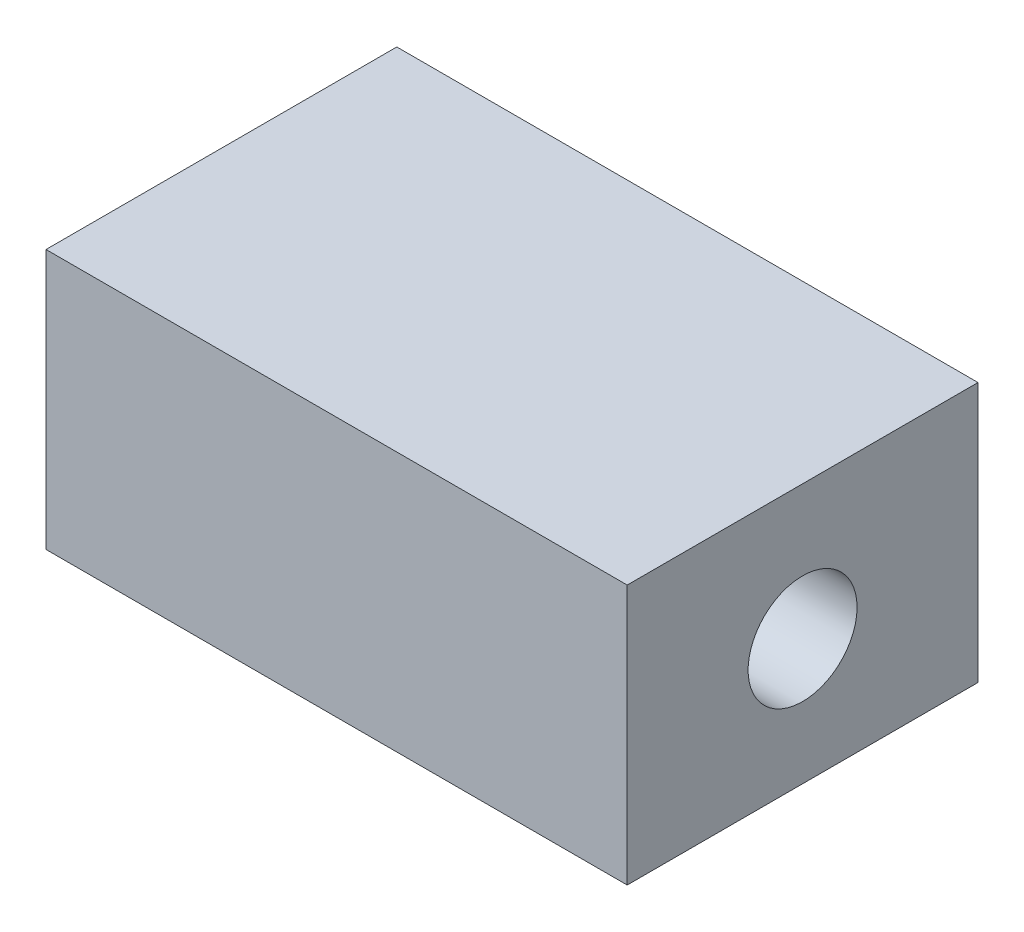
ISO-10303-21;
HEADER;
FILE_DESCRIPTION(('STEP AP214'),'2;1');
FILE_NAME('part.step','',(''),(''),'','','');
FILE_SCHEMA(('AUTOMOTIVE_DESIGN { 1 0 10303 214 1 1 1 1 }'));
ENDSEC;
DATA;
#1=APPLICATION_CONTEXT('core data for automotive mechanical design processes');
#2=APPLICATION_PROTOCOL_DEFINITION('international standard','automotive_design',2000,#1);
#3=PRODUCT_CONTEXT('',#1,'mechanical');
#4=PRODUCT('Part','Part','',(#3));
#5=PRODUCT_RELATED_PRODUCT_CATEGORY('part','',(#4));
#6=PRODUCT_DEFINITION_FORMATION('','',#4);
#7=PRODUCT_DEFINITION_CONTEXT('part definition',#1,'design');
#8=PRODUCT_DEFINITION('design','',#6,#7);
#9=PRODUCT_DEFINITION_SHAPE('','',#8);
#10=(LENGTH_UNIT() NAMED_UNIT(*) SI_UNIT(.MILLI.,.METRE.));
#11=(NAMED_UNIT(*) PLANE_ANGLE_UNIT() SI_UNIT($,.RADIAN.));
#12=(NAMED_UNIT(*) SI_UNIT($,.STERADIAN.) SOLID_ANGLE_UNIT());
#13=UNCERTAINTY_MEASURE_WITH_UNIT(LENGTH_MEASURE(1.E-05),#10,'distance_accuracy_value','');
#14=(GEOMETRIC_REPRESENTATION_CONTEXT(3) GLOBAL_UNCERTAINTY_ASSIGNED_CONTEXT((#13)) GLOBAL_UNIT_ASSIGNED_CONTEXT((#10,
#11,#12)) REPRESENTATION_CONTEXT('',''));
#15=CARTESIAN_POINT('',(0.,0.,0.));
#16=DIRECTION('',(0.,0.,1.));
#17=DIRECTION('',(1.,0.,0.));
#18=AXIS2_PLACEMENT_3D('',#15,#16,#17);
#19=CARTESIAN_POINT('',(55.9256768537199,50.,-33.7539588111209));
#20=DIRECTION('',(-1.,0.,0.));
#21=DIRECTION('',(0.,0.,1.));
#22=AXIS2_PLACEMENT_3D('',#19,#20,#21);
#23=PLANE('',#22);
#24=CARTESIAN_POINT('',(55.9256768537199,24.1825877409828,0.));
#25=DIRECTION('',(1.,0.,0.));
#26=DIRECTION('',(0.,0.,-1.));
#27=AXIS2_PLACEMENT_3D('',#24,#25,#26);
#28=CIRCLE('',#27,10.4813649082559);
#29=CARTESIAN_POINT('',(55.9256768537199,24.1825877409828,-10.4813649082559));
#30=VERTEX_POINT('',#29);
#31=EDGE_CURVE('E114',#30,#30,#28,.T.);
#32=ORIENTED_EDGE('',*,*,#31,.F.);
#33=EDGE_LOOP('',(#32));
#34=FACE_BOUND('',#33,.T.);
#35=DIRECTION('',(0.,0.,-1.));
#36=VECTOR('',#35,1.);
#37=CARTESIAN_POINT('',(55.9256768537199,0.,-33.7539588111209));
#38=LINE('',#37,#36);
#39=CARTESIAN_POINT('',(55.9256768537199,0.,33.7539588111209));
#40=VERTEX_POINT('',#39);
#41=CARTESIAN_POINT('',(55.9256768537199,0.,-33.7539588111209));
#42=VERTEX_POINT('',#41);
#43=EDGE_CURVE('E100',#40,#42,#38,.T.);
#44=ORIENTED_EDGE('',*,*,#43,.T.);
#45=DIRECTION('',(0.,-1.,0.));
#46=VECTOR('',#45,1.);
#47=CARTESIAN_POINT('',(55.9256768537199,50.,-33.7539588111209));
#48=LINE('',#47,#46);
#49=CARTESIAN_POINT('',(55.9256768537199,50.,-33.7539588111209));
#50=VERTEX_POINT('',#49);
#51=EDGE_CURVE('E11',#50,#42,#48,.T.);
#52=ORIENTED_EDGE('',*,*,#51,.F.);
#53=DIRECTION('',(0.,0.,-1.));
#54=VECTOR('',#53,1.);
#55=CARTESIAN_POINT('',(55.9256768537199,50.,-33.7539588111209));
#56=LINE('',#55,#54);
#57=CARTESIAN_POINT('',(55.9256768537199,50.,33.7539588111209));
#58=VERTEX_POINT('',#57);
#59=EDGE_CURVE('E88',#58,#50,#56,.T.);
#60=ORIENTED_EDGE('',*,*,#59,.F.);
#61=DIRECTION('',(0.,-1.,0.));
#62=VECTOR('',#61,1.);
#63=CARTESIAN_POINT('',(55.9256768537199,50.,33.7539588111209));
#64=LINE('',#63,#62);
#65=EDGE_CURVE('E96',#58,#40,#64,.T.);
#66=ORIENTED_EDGE('',*,*,#65,.T.);
#67=EDGE_LOOP('',(#44,#52,#60,#66));
#68=FACE_BOUND('',#67,.T.);
#69=ADVANCED_FACE('F37',(#34,#68),#23,.F.);
#70=CARTESIAN_POINT('',(-55.9256768537199,50.,-33.7539588111209));
#71=DIRECTION('',(0.,0.,1.));
#72=DIRECTION('',(1.,0.,0.));
#73=AXIS2_PLACEMENT_3D('',#70,#71,#72);
#74=PLANE('',#73);
#75=DIRECTION('',(-1.,0.,0.));
#76=VECTOR('',#75,1.);
#77=CARTESIAN_POINT('',(-55.9256768537199,0.,-33.7539588111209));
#78=LINE('',#77,#76);
#79=CARTESIAN_POINT('',(-55.9256768537199,0.,-33.7539588111209));
#80=VERTEX_POINT('',#79);
#81=EDGE_CURVE('E92',#42,#80,#78,.T.);
#82=ORIENTED_EDGE('',*,*,#81,.T.);
#83=DIRECTION('',(0.,-1.,0.));
#84=VECTOR('',#83,1.);
#85=CARTESIAN_POINT('',(-55.9256768537199,50.,-33.7539588111209));
#86=LINE('',#85,#84);
#87=CARTESIAN_POINT('',(-55.9256768537199,50.,-33.7539588111209));
#88=VERTEX_POINT('',#87);
#89=EDGE_CURVE('E45',#88,#80,#86,.T.);
#90=ORIENTED_EDGE('',*,*,#89,.F.);
#91=DIRECTION('',(-1.,0.,0.));
#92=VECTOR('',#91,1.);
#93=CARTESIAN_POINT('',(-55.9256768537199,50.,-33.7539588111209));
#94=LINE('',#93,#92);
#95=EDGE_CURVE('E83',#50,#88,#94,.T.);
#96=ORIENTED_EDGE('',*,*,#95,.F.);
#97=ORIENTED_EDGE('',*,*,#51,.T.);
#98=EDGE_LOOP('',(#82,#90,#96,#97));
#99=FACE_BOUND('',#98,.T.);
#100=ADVANCED_FACE('F91',(#99),#74,.F.);
#101=CARTESIAN_POINT('',(-55.9256768537199,50.,-33.7539588111209));
#102=DIRECTION('',(1.,0.,0.));
#103=DIRECTION('',(0.,0.,-1.));
#104=AXIS2_PLACEMENT_3D('',#101,#102,#103);
#105=PLANE('',#104);
#106=CARTESIAN_POINT('',(-55.9256768537199,24.1825877409828,0.));
#107=DIRECTION('',(1.,0.,0.));
#108=DIRECTION('',(0.,0.,-1.));
#109=AXIS2_PLACEMENT_3D('',#106,#107,#108);
#110=CIRCLE('',#109,10.4813649082559);
#111=CARTESIAN_POINT('',(-55.9256768537199,24.1825877409828,-10.4813649082559));
#112=VERTEX_POINT('',#111);
#113=EDGE_CURVE('E103',#112,#112,#110,.T.);
#114=ORIENTED_EDGE('',*,*,#113,.T.);
#115=EDGE_LOOP('',(#114));
#116=FACE_BOUND('',#115,.T.);
#117=DIRECTION('',(0.,0.,1.));
#118=VECTOR('',#117,1.);
#119=CARTESIAN_POINT('',(-55.9256768537199,0.,-33.7539588111209));
#120=LINE('',#119,#118);
#121=CARTESIAN_POINT('',(-55.9256768537199,0.,33.7539588111209));
#122=VERTEX_POINT('',#121);
#123=EDGE_CURVE('E70',#80,#122,#120,.T.);
#124=ORIENTED_EDGE('',*,*,#123,.T.);
#125=DIRECTION('',(0.,-1.,0.));
#126=VECTOR('',#125,1.);
#127=CARTESIAN_POINT('',(-55.9256768537199,50.,33.7539588111209));
#128=LINE('',#127,#126);
#129=CARTESIAN_POINT('',(-55.9256768537199,50.,33.7539588111209));
#130=VERTEX_POINT('',#129);
#131=EDGE_CURVE('E93',#130,#122,#128,.T.);
#132=ORIENTED_EDGE('',*,*,#131,.F.);
#133=DIRECTION('',(0.,0.,1.));
#134=VECTOR('',#133,1.);
#135=CARTESIAN_POINT('',(-55.9256768537199,50.,-33.7539588111209));
#136=LINE('',#135,#134);
#137=EDGE_CURVE('E86',#88,#130,#136,.T.);
#138=ORIENTED_EDGE('',*,*,#137,.F.);
#139=ORIENTED_EDGE('',*,*,#89,.T.);
#140=EDGE_LOOP('',(#124,#132,#138,#139));
#141=FACE_BOUND('',#140,.T.);
#142=ADVANCED_FACE('F94',(#116,#141),#105,.F.);
#143=CARTESIAN_POINT('',(-55.9256768537199,50.,33.7539588111209));
#144=DIRECTION('',(0.,0.,-1.));
#145=DIRECTION('',(-1.,0.,0.));
#146=AXIS2_PLACEMENT_3D('',#143,#144,#145);
#147=PLANE('',#146);
#148=DIRECTION('',(1.,0.,0.));
#149=VECTOR('',#148,1.);
#150=CARTESIAN_POINT('',(-55.9256768537199,0.,33.7539588111209));
#151=LINE('',#150,#149);
#152=EDGE_CURVE('E76',#122,#40,#151,.T.);
#153=ORIENTED_EDGE('',*,*,#152,.T.);
#154=ORIENTED_EDGE('',*,*,#65,.F.);
#155=DIRECTION('',(1.,0.,0.));
#156=VECTOR('',#155,1.);
#157=CARTESIAN_POINT('',(-55.9256768537199,50.,33.7539588111209));
#158=LINE('',#157,#156);
#159=EDGE_CURVE('E53',#130,#58,#158,.T.);
#160=ORIENTED_EDGE('',*,*,#159,.F.);
#161=ORIENTED_EDGE('',*,*,#131,.T.);
#162=EDGE_LOOP('',(#153,#154,#160,#161));
#163=FACE_BOUND('',#162,.T.);
#164=ADVANCED_FACE('F108',(#163),#147,.F.);
#165=CARTESIAN_POINT('',(0.,50.,0.));
#166=DIRECTION('',(0.,1.,0.));
#167=DIRECTION('',(0.,0.,1.));
#168=AXIS2_PLACEMENT_3D('',#165,#166,#167);
#169=PLANE('',#168);
#170=ORIENTED_EDGE('',*,*,#59,.T.);
#171=ORIENTED_EDGE('',*,*,#95,.T.);
#172=ORIENTED_EDGE('',*,*,#137,.T.);
#173=ORIENTED_EDGE('',*,*,#159,.T.);
#174=EDGE_LOOP('',(#170,#171,#172,#173));
#175=FACE_BOUND('',#174,.T.);
#176=ADVANCED_FACE('F84',(#175),#169,.T.);
#177=CARTESIAN_POINT('',(0.,0.,0.));
#178=DIRECTION('',(0.,1.,0.));
#179=DIRECTION('',(0.,0.,1.));
#180=AXIS2_PLACEMENT_3D('',#177,#178,#179);
#181=PLANE('',#180);
#182=ORIENTED_EDGE('',*,*,#43,.F.);
#183=ORIENTED_EDGE('',*,*,#152,.F.);
#184=ORIENTED_EDGE('',*,*,#123,.F.);
#185=ORIENTED_EDGE('',*,*,#81,.F.);
#186=EDGE_LOOP('',(#182,#183,#184,#185));
#187=FACE_BOUND('',#186,.T.);
#188=ADVANCED_FACE('F111',(#187),#181,.F.);
#189=CARTESIAN_POINT('',(-55.9256768537199,24.1825877409828,0.));
#190=DIRECTION('',(1.,0.,0.));
#191=DIRECTION('',(0.,0.,-1.));
#192=AXIS2_PLACEMENT_3D('',#189,#190,#191);
#193=CYLINDRICAL_SURFACE('',#192,10.4813649082559);
#194=ORIENTED_EDGE('',*,*,#113,.F.);
#195=EDGE_LOOP('',(#194));
#196=FACE_BOUND('',#195,.T.);
#197=ORIENTED_EDGE('',*,*,#31,.T.);
#198=EDGE_LOOP('',(#197));
#199=FACE_BOUND('',#198,.T.);
#200=ADVANCED_FACE('F121',(#196,#199),#193,.F.);
#201=CLOSED_SHELL('',(#69,#100,#142,#164,#176,#188,#200));
#202=MANIFOLD_SOLID_BREP('B2',#201);
#203=ADVANCED_BREP_SHAPE_REPRESENTATION('',(#18,#202),#14);
#204=SHAPE_DEFINITION_REPRESENTATION(#9,#203);
ENDSEC;
END-ISO-10303-21;
